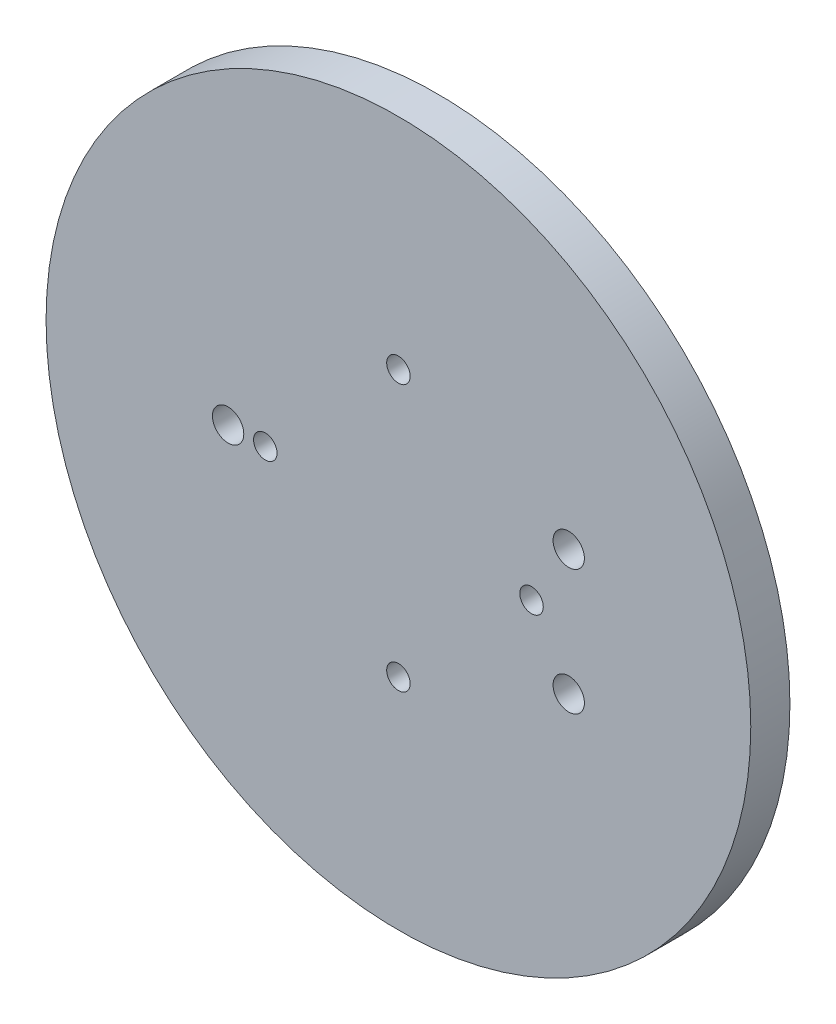
ISO-10303-21;
HEADER;
FILE_DESCRIPTION(('STEP AP214'),'2;1');
FILE_NAME('part.step','',(''),(''),'','','');
FILE_SCHEMA(('AUTOMOTIVE_DESIGN { 1 0 10303 214 1 1 1 1 }'));
ENDSEC;
DATA;
#1=APPLICATION_CONTEXT('core data for automotive mechanical design processes');
#2=APPLICATION_PROTOCOL_DEFINITION('international standard','automotive_design',2000,#1);
#3=PRODUCT_CONTEXT('',#1,'mechanical');
#4=PRODUCT('Part','Part','',(#3));
#5=PRODUCT_RELATED_PRODUCT_CATEGORY('part','',(#4));
#6=PRODUCT_DEFINITION_FORMATION('','',#4);
#7=PRODUCT_DEFINITION_CONTEXT('part definition',#1,'design');
#8=PRODUCT_DEFINITION('design','',#6,#7);
#9=PRODUCT_DEFINITION_SHAPE('','',#8);
#10=(LENGTH_UNIT() NAMED_UNIT(*) SI_UNIT(.MILLI.,.METRE.));
#11=(NAMED_UNIT(*) PLANE_ANGLE_UNIT() SI_UNIT($,.RADIAN.));
#12=(NAMED_UNIT(*) SI_UNIT($,.STERADIAN.) SOLID_ANGLE_UNIT());
#13=UNCERTAINTY_MEASURE_WITH_UNIT(LENGTH_MEASURE(1.E-05),#10,'distance_accuracy_value','');
#14=(GEOMETRIC_REPRESENTATION_CONTEXT(3) GLOBAL_UNCERTAINTY_ASSIGNED_CONTEXT((#13)) GLOBAL_UNIT_ASSIGNED_CONTEXT((#10,
#11,#12)) REPRESENTATION_CONTEXT('',''));
#15=CARTESIAN_POINT('',(0.,0.,0.));
#16=DIRECTION('',(0.,0.,1.));
#17=DIRECTION('',(1.,0.,0.));
#18=AXIS2_PLACEMENT_3D('',#15,#16,#17);
#19=CARTESIAN_POINT('',(0.,0.,5.));
#20=DIRECTION('',(0.,0.,-1.));
#21=DIRECTION('',(-1.,0.,0.));
#22=AXIS2_PLACEMENT_3D('',#19,#20,#21);
#23=CYLINDRICAL_SURFACE('',#22,45.);
#24=CARTESIAN_POINT('',(0.,0.,5.));
#25=DIRECTION('',(0.,0.,1.));
#26=DIRECTION('',(1.,0.,0.));
#27=AXIS2_PLACEMENT_3D('',#24,#25,#26);
#28=CIRCLE('',#27,45.);
#29=CARTESIAN_POINT('',(45.,0.,5.));
#30=VERTEX_POINT('',#29);
#31=EDGE_CURVE('E10',#30,#30,#28,.T.);
#32=ORIENTED_EDGE('',*,*,#31,.F.);
#33=EDGE_LOOP('',(#32));
#34=FACE_BOUND('',#33,.T.);
#35=CARTESIAN_POINT('',(0.,0.,0.));
#36=DIRECTION('',(0.,0.,1.));
#37=DIRECTION('',(1.,0.,0.));
#38=AXIS2_PLACEMENT_3D('',#35,#36,#37);
#39=CIRCLE('',#38,45.);
#40=CARTESIAN_POINT('',(45.,0.,0.));
#41=VERTEX_POINT('',#40);
#42=EDGE_CURVE('E40',#41,#41,#39,.T.);
#43=ORIENTED_EDGE('',*,*,#42,.T.);
#44=EDGE_LOOP('',(#43));
#45=FACE_BOUND('',#44,.T.);
#46=ADVANCED_FACE('F33',(#34,#45),#23,.T.);
#47=CARTESIAN_POINT('',(0.,0.,5.));
#48=DIRECTION('',(0.,0.,1.));
#49=DIRECTION('',(1.,0.,0.));
#50=AXIS2_PLACEMENT_3D('',#47,#48,#49);
#51=PLANE('',#50);
#52=CARTESIAN_POINT('',(-17.,1.85426047935268E-13,5.));
#53=DIRECTION('',(0.,0.,1.));
#54=DIRECTION('',(1.,0.,0.));
#55=AXIS2_PLACEMENT_3D('',#52,#53,#54);
#56=CIRCLE('',#55,1.5);
#57=CARTESIAN_POINT('',(-15.5,1.85426047935268E-13,5.));
#58=VERTEX_POINT('',#57);
#59=EDGE_CURVE('E146',#58,#58,#56,.T.);
#60=ORIENTED_EDGE('',*,*,#59,.F.);
#61=EDGE_LOOP('',(#60));
#62=FACE_BOUND('',#61,.T.);
#63=CARTESIAN_POINT('',(-1.26070865174935E-13,-17.,5.));
#64=DIRECTION('',(0.,0.,1.));
#65=DIRECTION('',(1.,0.,0.));
#66=AXIS2_PLACEMENT_3D('',#63,#64,#65);
#67=CIRCLE('',#66,1.5);
#68=CARTESIAN_POINT('',(1.49999999999987,-17.,5.));
#69=VERTEX_POINT('',#68);
#70=EDGE_CURVE('E140',#69,#69,#67,.T.);
#71=ORIENTED_EDGE('',*,*,#70,.F.);
#72=EDGE_LOOP('',(#71));
#73=FACE_BOUND('',#72,.T.);
#74=CARTESIAN_POINT('',(17.,0.,5.));
#75=DIRECTION('',(0.,0.,1.));
#76=DIRECTION('',(1.,0.,0.));
#77=AXIS2_PLACEMENT_3D('',#74,#75,#76);
#78=CIRCLE('',#77,1.5);
#79=CARTESIAN_POINT('',(18.5,0.,5.));
#80=VERTEX_POINT('',#79);
#81=EDGE_CURVE('E121',#80,#80,#78,.T.);
#82=ORIENTED_EDGE('',*,*,#81,.F.);
#83=EDGE_LOOP('',(#82));
#84=FACE_BOUND('',#83,.T.);
#85=CARTESIAN_POINT('',(21.75,8.,5.));
#86=DIRECTION('',(0.,0.,1.));
#87=DIRECTION('',(1.,0.,0.));
#88=AXIS2_PLACEMENT_3D('',#85,#86,#87);
#89=CIRCLE('',#88,2.);
#90=CARTESIAN_POINT('',(23.75,8.,5.));
#91=VERTEX_POINT('',#90);
#92=EDGE_CURVE('E57',#91,#91,#89,.T.);
#93=ORIENTED_EDGE('',*,*,#92,.F.);
#94=EDGE_LOOP('',(#93));
#95=FACE_BOUND('',#94,.T.);
#96=CARTESIAN_POINT('',(21.75,-8.,5.));
#97=DIRECTION('',(0.,0.,1.));
#98=DIRECTION('',(1.,0.,0.));
#99=AXIS2_PLACEMENT_3D('',#96,#97,#98);
#100=CIRCLE('',#99,2.);
#101=CARTESIAN_POINT('',(23.75,-8.,5.));
#102=VERTEX_POINT('',#101);
#103=EDGE_CURVE('E143',#102,#102,#100,.T.);
#104=ORIENTED_EDGE('',*,*,#103,.F.);
#105=EDGE_LOOP('',(#104));
#106=FACE_BOUND('',#105,.T.);
#107=CARTESIAN_POINT('',(0.,17.,5.));
#108=DIRECTION('',(0.,0.,1.));
#109=DIRECTION('',(1.,0.,0.));
#110=AXIS2_PLACEMENT_3D('',#107,#108,#109);
#111=CIRCLE('',#110,1.5);
#112=CARTESIAN_POINT('',(1.50000000000001,17.,5.));
#113=VERTEX_POINT('',#112);
#114=EDGE_CURVE('E139',#113,#113,#111,.T.);
#115=ORIENTED_EDGE('',*,*,#114,.F.);
#116=EDGE_LOOP('',(#115));
#117=FACE_BOUND('',#116,.T.);
#118=CARTESIAN_POINT('',(-21.75,0.,5.));
#119=DIRECTION('',(0.,0.,1.));
#120=DIRECTION('',(1.,0.,0.));
#121=AXIS2_PLACEMENT_3D('',#118,#119,#120);
#122=CIRCLE('',#121,2.);
#123=CARTESIAN_POINT('',(-19.75,0.,5.));
#124=VERTEX_POINT('',#123);
#125=EDGE_CURVE('E48',#124,#124,#122,.T.);
#126=ORIENTED_EDGE('',*,*,#125,.F.);
#127=EDGE_LOOP('',(#126));
#128=FACE_BOUND('',#127,.T.);
#129=ORIENTED_EDGE('',*,*,#31,.T.);
#130=EDGE_LOOP('',(#129));
#131=FACE_BOUND('',#130,.T.);
#132=ADVANCED_FACE('F78',(#62,#73,#84,#95,#106,#117,#128,#131),#51,.T.);
#133=CARTESIAN_POINT('',(0.,0.,0.));
#134=DIRECTION('',(0.,0.,1.));
#135=DIRECTION('',(1.,0.,0.));
#136=AXIS2_PLACEMENT_3D('',#133,#134,#135);
#137=PLANE('',#136);
#138=CARTESIAN_POINT('',(-17.,1.85426047935268E-13,0.));
#139=DIRECTION('',(0.,0.,1.));
#140=DIRECTION('',(1.,0.,0.));
#141=AXIS2_PLACEMENT_3D('',#138,#139,#140);
#142=CIRCLE('',#141,1.5);
#143=CARTESIAN_POINT('',(-15.5,1.85426047935268E-13,0.));
#144=VERTEX_POINT('',#143);
#145=EDGE_CURVE('E36',#144,#144,#142,.T.);
#146=ORIENTED_EDGE('',*,*,#145,.T.);
#147=EDGE_LOOP('',(#146));
#148=FACE_BOUND('',#147,.T.);
#149=CARTESIAN_POINT('',(-1.26070865174935E-13,-17.,0.));
#150=DIRECTION('',(0.,0.,1.));
#151=DIRECTION('',(1.,0.,0.));
#152=AXIS2_PLACEMENT_3D('',#149,#150,#151);
#153=CIRCLE('',#152,1.5);
#154=CARTESIAN_POINT('',(1.49999999999987,-17.,0.));
#155=VERTEX_POINT('',#154);
#156=EDGE_CURVE('E65',#155,#155,#153,.T.);
#157=ORIENTED_EDGE('',*,*,#156,.T.);
#158=EDGE_LOOP('',(#157));
#159=FACE_BOUND('',#158,.T.);
#160=CARTESIAN_POINT('',(17.,0.,0.));
#161=DIRECTION('',(0.,0.,1.));
#162=DIRECTION('',(1.,0.,0.));
#163=AXIS2_PLACEMENT_3D('',#160,#161,#162);
#164=CIRCLE('',#163,1.5);
#165=CARTESIAN_POINT('',(18.5,0.,0.));
#166=VERTEX_POINT('',#165);
#167=EDGE_CURVE('E63',#166,#166,#164,.T.);
#168=ORIENTED_EDGE('',*,*,#167,.T.);
#169=EDGE_LOOP('',(#168));
#170=FACE_BOUND('',#169,.T.);
#171=CARTESIAN_POINT('',(21.75,8.,0.));
#172=DIRECTION('',(0.,0.,1.));
#173=DIRECTION('',(1.,0.,0.));
#174=AXIS2_PLACEMENT_3D('',#171,#172,#173);
#175=CIRCLE('',#174,2.);
#176=CARTESIAN_POINT('',(23.75,8.,0.));
#177=VERTEX_POINT('',#176);
#178=EDGE_CURVE('E60',#177,#177,#175,.T.);
#179=ORIENTED_EDGE('',*,*,#178,.T.);
#180=EDGE_LOOP('',(#179));
#181=FACE_BOUND('',#180,.T.);
#182=CARTESIAN_POINT('',(21.75,-8.,0.));
#183=DIRECTION('',(0.,0.,1.));
#184=DIRECTION('',(1.,0.,0.));
#185=AXIS2_PLACEMENT_3D('',#182,#183,#184);
#186=CIRCLE('',#185,2.);
#187=CARTESIAN_POINT('',(23.75,-8.,0.));
#188=VERTEX_POINT('',#187);
#189=EDGE_CURVE('E56',#188,#188,#186,.T.);
#190=ORIENTED_EDGE('',*,*,#189,.T.);
#191=EDGE_LOOP('',(#190));
#192=FACE_BOUND('',#191,.T.);
#193=CARTESIAN_POINT('',(0.,17.,0.));
#194=DIRECTION('',(0.,0.,1.));
#195=DIRECTION('',(1.,0.,0.));
#196=AXIS2_PLACEMENT_3D('',#193,#194,#195);
#197=CIRCLE('',#196,1.5);
#198=CARTESIAN_POINT('',(1.50000000000001,17.,0.));
#199=VERTEX_POINT('',#198);
#200=EDGE_CURVE('E53',#199,#199,#197,.T.);
#201=ORIENTED_EDGE('',*,*,#200,.T.);
#202=EDGE_LOOP('',(#201));
#203=FACE_BOUND('',#202,.T.);
#204=CARTESIAN_POINT('',(-21.75,0.,0.));
#205=DIRECTION('',(0.,0.,1.));
#206=DIRECTION('',(1.,0.,0.));
#207=AXIS2_PLACEMENT_3D('',#204,#205,#206);
#208=CIRCLE('',#207,2.);
#209=CARTESIAN_POINT('',(-19.75,0.,0.));
#210=VERTEX_POINT('',#209);
#211=EDGE_CURVE('E45',#210,#210,#208,.T.);
#212=ORIENTED_EDGE('',*,*,#211,.T.);
#213=EDGE_LOOP('',(#212));
#214=FACE_BOUND('',#213,.T.);
#215=ORIENTED_EDGE('',*,*,#42,.F.);
#216=EDGE_LOOP('',(#215));
#217=FACE_BOUND('',#216,.T.);
#218=ADVANCED_FACE('F80',(#148,#159,#170,#181,#192,#203,#214,#217),#137,.F.);
#219=CARTESIAN_POINT('',(-21.75,0.,-5.));
#220=DIRECTION('',(0.,0.,1.));
#221=DIRECTION('',(1.,0.,0.));
#222=AXIS2_PLACEMENT_3D('',#219,#220,#221);
#223=CYLINDRICAL_SURFACE('',#222,2.);
#224=ORIENTED_EDGE('',*,*,#125,.T.);
#225=EDGE_LOOP('',(#224));
#226=FACE_BOUND('',#225,.T.);
#227=ORIENTED_EDGE('',*,*,#211,.F.);
#228=EDGE_LOOP('',(#227));
#229=FACE_BOUND('',#228,.T.);
#230=ADVANCED_FACE('F75',(#226,#229),#223,.F.);
#231=CARTESIAN_POINT('',(0.,17.,-5.));
#232=DIRECTION('',(0.,0.,1.));
#233=DIRECTION('',(1.,0.,0.));
#234=AXIS2_PLACEMENT_3D('',#231,#232,#233);
#235=CYLINDRICAL_SURFACE('',#234,1.5);
#236=ORIENTED_EDGE('',*,*,#114,.T.);
#237=EDGE_LOOP('',(#236));
#238=FACE_BOUND('',#237,.T.);
#239=ORIENTED_EDGE('',*,*,#200,.F.);
#240=EDGE_LOOP('',(#239));
#241=FACE_BOUND('',#240,.T.);
#242=ADVANCED_FACE('F93',(#238,#241),#235,.F.);
#243=CARTESIAN_POINT('',(21.75,-8.,-5.));
#244=DIRECTION('',(0.,0.,1.));
#245=DIRECTION('',(1.,0.,0.));
#246=AXIS2_PLACEMENT_3D('',#243,#244,#245);
#247=CYLINDRICAL_SURFACE('',#246,2.);
#248=ORIENTED_EDGE('',*,*,#103,.T.);
#249=EDGE_LOOP('',(#248));
#250=FACE_BOUND('',#249,.T.);
#251=ORIENTED_EDGE('',*,*,#189,.F.);
#252=EDGE_LOOP('',(#251));
#253=FACE_BOUND('',#252,.T.);
#254=ADVANCED_FACE('F98',(#250,#253),#247,.F.);
#255=CARTESIAN_POINT('',(21.75,8.,-5.));
#256=DIRECTION('',(0.,0.,1.));
#257=DIRECTION('',(1.,0.,0.));
#258=AXIS2_PLACEMENT_3D('',#255,#256,#257);
#259=CYLINDRICAL_SURFACE('',#258,2.);
#260=ORIENTED_EDGE('',*,*,#92,.T.);
#261=EDGE_LOOP('',(#260));
#262=FACE_BOUND('',#261,.T.);
#263=ORIENTED_EDGE('',*,*,#178,.F.);
#264=EDGE_LOOP('',(#263));
#265=FACE_BOUND('',#264,.T.);
#266=ADVANCED_FACE('F94',(#262,#265),#259,.F.);
#267=CARTESIAN_POINT('',(17.,0.,-5.));
#268=DIRECTION('',(0.,0.,1.));
#269=DIRECTION('',(1.,0.,0.));
#270=AXIS2_PLACEMENT_3D('',#267,#268,#269);
#271=CYLINDRICAL_SURFACE('',#270,1.5);
#272=ORIENTED_EDGE('',*,*,#81,.T.);
#273=EDGE_LOOP('',(#272));
#274=FACE_BOUND('',#273,.T.);
#275=ORIENTED_EDGE('',*,*,#167,.F.);
#276=EDGE_LOOP('',(#275));
#277=FACE_BOUND('',#276,.T.);
#278=ADVANCED_FACE('F97',(#274,#277),#271,.F.);
#279=CARTESIAN_POINT('',(-1.26070865174935E-13,-17.,-5.));
#280=DIRECTION('',(0.,0.,1.));
#281=DIRECTION('',(1.,0.,0.));
#282=AXIS2_PLACEMENT_3D('',#279,#280,#281);
#283=CYLINDRICAL_SURFACE('',#282,1.5);
#284=ORIENTED_EDGE('',*,*,#70,.T.);
#285=EDGE_LOOP('',(#284));
#286=FACE_BOUND('',#285,.T.);
#287=ORIENTED_EDGE('',*,*,#156,.F.);
#288=EDGE_LOOP('',(#287));
#289=FACE_BOUND('',#288,.T.);
#290=ADVANCED_FACE('F109',(#286,#289),#283,.F.);
#291=CARTESIAN_POINT('',(-17.,1.85426047935268E-13,-5.));
#292=DIRECTION('',(0.,0.,1.));
#293=DIRECTION('',(1.,0.,0.));
#294=AXIS2_PLACEMENT_3D('',#291,#292,#293);
#295=CYLINDRICAL_SURFACE('',#294,1.5);
#296=ORIENTED_EDGE('',*,*,#59,.T.);
#297=EDGE_LOOP('',(#296));
#298=FACE_BOUND('',#297,.T.);
#299=ORIENTED_EDGE('',*,*,#145,.F.);
#300=EDGE_LOOP('',(#299));
#301=FACE_BOUND('',#300,.T.);
#302=ADVANCED_FACE('F106',(#298,#301),#295,.F.);
#303=CLOSED_SHELL('',(#46,#132,#218,#230,#242,#254,#266,#278,#290,#302));
#304=MANIFOLD_SOLID_BREP('B2',#303);
#305=ADVANCED_BREP_SHAPE_REPRESENTATION('',(#18,#304),#14);
#306=SHAPE_DEFINITION_REPRESENTATION(#9,#305);
ENDSEC;
END-ISO-10303-21;
